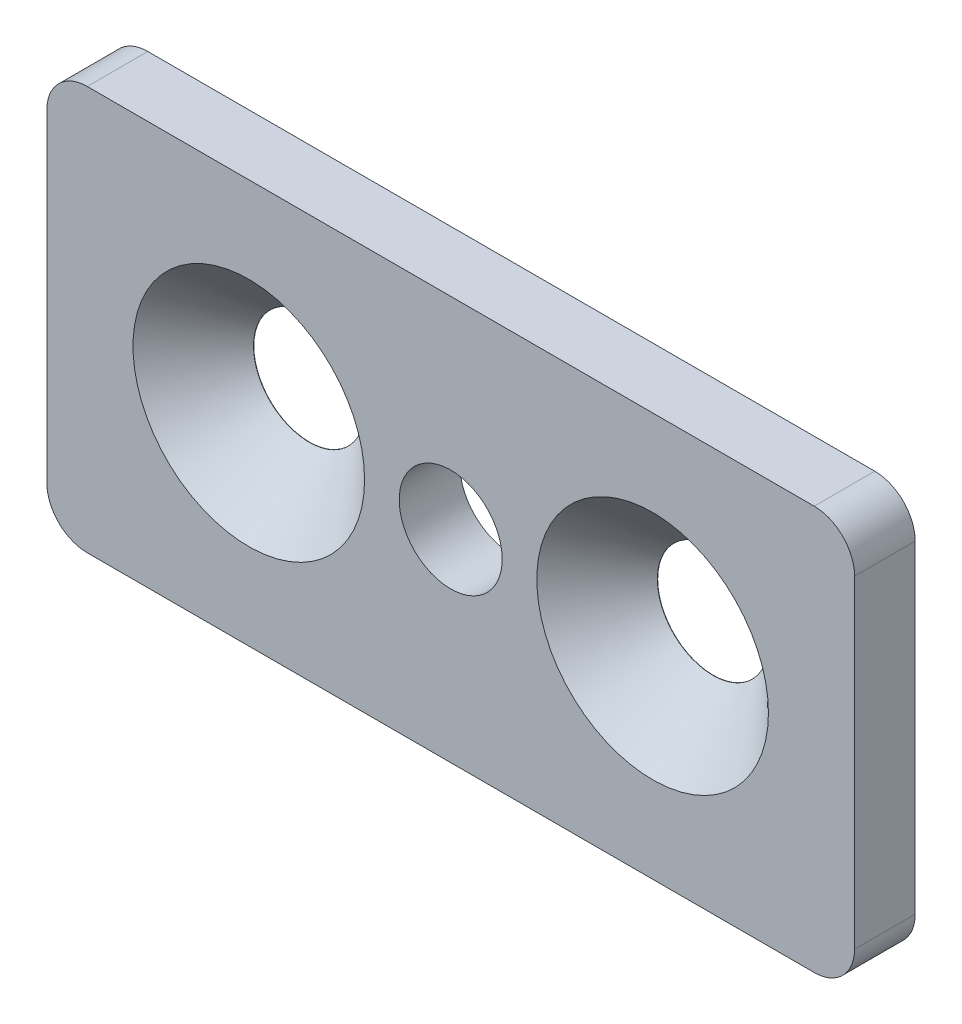
ISO-10303-21;
HEADER;
FILE_DESCRIPTION(('STEP AP214'),'2;1');
FILE_NAME('part.step','',(''),(''),'','','');
FILE_SCHEMA(('AUTOMOTIVE_DESIGN { 1 0 10303 214 1 1 1 1 }'));
ENDSEC;
DATA;
#1=APPLICATION_CONTEXT('core data for automotive mechanical design processes');
#2=APPLICATION_PROTOCOL_DEFINITION('international standard','automotive_design',2000,#1);
#3=PRODUCT_CONTEXT('',#1,'mechanical');
#4=PRODUCT('Part','Part','',(#3));
#5=PRODUCT_RELATED_PRODUCT_CATEGORY('part','',(#4));
#6=PRODUCT_DEFINITION_FORMATION('','',#4);
#7=PRODUCT_DEFINITION_CONTEXT('part definition',#1,'design');
#8=PRODUCT_DEFINITION('design','',#6,#7);
#9=PRODUCT_DEFINITION_SHAPE('','',#8);
#10=(LENGTH_UNIT() NAMED_UNIT(*) SI_UNIT(.MILLI.,.METRE.));
#11=(NAMED_UNIT(*) PLANE_ANGLE_UNIT() SI_UNIT($,.RADIAN.));
#12=(NAMED_UNIT(*) SI_UNIT($,.STERADIAN.) SOLID_ANGLE_UNIT());
#13=UNCERTAINTY_MEASURE_WITH_UNIT(LENGTH_MEASURE(1.E-05),#10,'distance_accuracy_value','');
#14=(GEOMETRIC_REPRESENTATION_CONTEXT(3) GLOBAL_UNCERTAINTY_ASSIGNED_CONTEXT((#13)) GLOBAL_UNIT_ASSIGNED_CONTEXT((#10,
#11,#12)) REPRESENTATION_CONTEXT('',''));
#15=CARTESIAN_POINT('',(0.,0.,0.));
#16=DIRECTION('',(0.,0.,1.));
#17=DIRECTION('',(1.,0.,0.));
#18=AXIS2_PLACEMENT_3D('',#15,#16,#17);
#19=CARTESIAN_POINT('',(2.,2.,3.));
#20=DIRECTION('',(0.,0.,-1.));
#21=DIRECTION('',(-1.,0.,0.));
#22=AXIS2_PLACEMENT_3D('',#19,#20,#21);
#23=PLANE('',#22);
#24=CARTESIAN_POINT('',(10.,10.,3.));
#25=DIRECTION('',(0.,0.,1.));
#26=DIRECTION('',(1.,0.,0.));
#27=AXIS2_PLACEMENT_3D('',#24,#25,#26);
#28=CIRCLE('',#27,5.735);
#29=CARTESIAN_POINT('',(15.735,10.,3.));
#30=VERTEX_POINT('',#29);
#31=EDGE_CURVE('E243',#30,#30,#28,.T.);
#32=ORIENTED_EDGE('',*,*,#31,.F.);
#33=EDGE_LOOP('',(#32));
#34=FACE_BOUND('',#33,.T.);
#35=CARTESIAN_POINT('',(30.,10.,3.));
#36=DIRECTION('',(0.,0.,1.));
#37=DIRECTION('',(1.,0.,0.));
#38=AXIS2_PLACEMENT_3D('',#35,#36,#37);
#39=CIRCLE('',#38,5.735);
#40=CARTESIAN_POINT('',(35.735,10.,3.));
#41=VERTEX_POINT('',#40);
#42=EDGE_CURVE('E168',#41,#41,#39,.T.);
#43=ORIENTED_EDGE('',*,*,#42,.F.);
#44=EDGE_LOOP('',(#43));
#45=FACE_BOUND('',#44,.T.);
#46=CARTESIAN_POINT('',(20.,10.,3.));
#47=DIRECTION('',(0.,0.,1.));
#48=DIRECTION('',(1.,0.,0.));
#49=AXIS2_PLACEMENT_3D('',#46,#47,#48);
#50=CIRCLE('',#49,2.55);
#51=CARTESIAN_POINT('',(22.55,10.,3.));
#52=VERTEX_POINT('',#51);
#53=EDGE_CURVE('E137',#52,#52,#50,.T.);
#54=ORIENTED_EDGE('',*,*,#53,.F.);
#55=EDGE_LOOP('',(#54));
#56=FACE_BOUND('',#55,.T.);
#57=CARTESIAN_POINT('',(2.,2.,3.));
#58=DIRECTION('',(0.,0.,1.));
#59=DIRECTION('',(-1.,0.,0.));
#60=AXIS2_PLACEMENT_3D('',#57,#58,#59);
#61=CIRCLE('',#60,2.);
#62=CARTESIAN_POINT('',(0.,2.,3.));
#63=VERTEX_POINT('',#62);
#64=CARTESIAN_POINT('',(2.,0.,3.));
#65=VERTEX_POINT('',#64);
#66=EDGE_CURVE('E148',#63,#65,#61,.T.);
#67=ORIENTED_EDGE('',*,*,#66,.T.);
#68=DIRECTION('',(1.,0.,0.));
#69=VECTOR('',#68,1.);
#70=CARTESIAN_POINT('',(2.,0.,3.));
#71=LINE('',#70,#69);
#72=CARTESIAN_POINT('',(38.,0.,3.));
#73=VERTEX_POINT('',#72);
#74=EDGE_CURVE('E97',#65,#73,#71,.T.);
#75=ORIENTED_EDGE('',*,*,#74,.T.);
#76=CARTESIAN_POINT('',(38.,2.00000000000001,3.));
#77=DIRECTION('',(0.,0.,1.));
#78=DIRECTION('',(1.,0.,0.));
#79=AXIS2_PLACEMENT_3D('',#76,#77,#78);
#80=CIRCLE('',#79,2.);
#81=CARTESIAN_POINT('',(40.,2.00000000000001,3.));
#82=VERTEX_POINT('',#81);
#83=EDGE_CURVE('E180',#73,#82,#80,.T.);
#84=ORIENTED_EDGE('',*,*,#83,.T.);
#85=DIRECTION('',(0.,1.,0.));
#86=VECTOR('',#85,1.);
#87=CARTESIAN_POINT('',(40.,2.00000000000001,3.));
#88=LINE('',#87,#86);
#89=CARTESIAN_POINT('',(40.,18.,3.));
#90=VERTEX_POINT('',#89);
#91=EDGE_CURVE('E182',#82,#90,#88,.T.);
#92=ORIENTED_EDGE('',*,*,#91,.T.);
#93=CARTESIAN_POINT('',(38.,18.,3.));
#94=DIRECTION('',(0.,0.,1.));
#95=DIRECTION('',(-1.,0.,0.));
#96=AXIS2_PLACEMENT_3D('',#93,#94,#95);
#97=CIRCLE('',#96,2.);
#98=CARTESIAN_POINT('',(38.,20.,3.));
#99=VERTEX_POINT('',#98);
#100=EDGE_CURVE('E115',#90,#99,#97,.T.);
#101=ORIENTED_EDGE('',*,*,#100,.T.);
#102=DIRECTION('',(-1.,0.,0.));
#103=VECTOR('',#102,1.);
#104=CARTESIAN_POINT('',(1.99999999999999,20.,3.));
#105=LINE('',#104,#103);
#106=CARTESIAN_POINT('',(1.99999999999999,20.,3.));
#107=VERTEX_POINT('',#106);
#108=EDGE_CURVE('E110',#99,#107,#105,.T.);
#109=ORIENTED_EDGE('',*,*,#108,.T.);
#110=CARTESIAN_POINT('',(2.,18.,3.));
#111=DIRECTION('',(0.,0.,1.));
#112=DIRECTION('',(-1.,0.,0.));
#113=AXIS2_PLACEMENT_3D('',#110,#111,#112);
#114=CIRCLE('',#113,2.);
#115=CARTESIAN_POINT('',(0.,18.,3.));
#116=VERTEX_POINT('',#115);
#117=EDGE_CURVE('E113',#107,#116,#114,.T.);
#118=ORIENTED_EDGE('',*,*,#117,.T.);
#119=DIRECTION('',(0.,-1.,0.));
#120=VECTOR('',#119,1.);
#121=CARTESIAN_POINT('',(0.,2.,3.));
#122=LINE('',#121,#120);
#123=EDGE_CURVE('E54',#116,#63,#122,.T.);
#124=ORIENTED_EDGE('',*,*,#123,.T.);
#125=EDGE_LOOP('',(#67,#75,#84,#92,#101,#109,#118,#124));
#126=FACE_BOUND('',#125,.T.);
#127=ADVANCED_FACE('F35',(#34,#45,#56,#126),#23,.F.);
#128=CARTESIAN_POINT('',(2.,2.,0.));
#129=DIRECTION('',(0.,0.,-1.));
#130=DIRECTION('',(-1.,0.,0.));
#131=AXIS2_PLACEMENT_3D('',#128,#129,#130);
#132=PLANE('',#131);
#133=CARTESIAN_POINT('',(10.,10.,0.));
#134=DIRECTION('',(0.,0.,-1.));
#135=DIRECTION('',(-1.,0.,0.));
#136=AXIS2_PLACEMENT_3D('',#133,#134,#135);
#137=CIRCLE('',#136,2.74999999999999);
#138=CARTESIAN_POINT('',(7.25000000000001,10.,0.));
#139=VERTEX_POINT('',#138);
#140=EDGE_CURVE('E39',#139,#139,#137,.T.);
#141=ORIENTED_EDGE('',*,*,#140,.F.);
#142=EDGE_LOOP('',(#141));
#143=FACE_BOUND('',#142,.T.);
#144=CARTESIAN_POINT('',(30.,10.,0.));
#145=DIRECTION('',(0.,0.,-1.));
#146=DIRECTION('',(-1.,0.,0.));
#147=AXIS2_PLACEMENT_3D('',#144,#145,#146);
#148=CIRCLE('',#147,2.75);
#149=CARTESIAN_POINT('',(27.25,10.,0.));
#150=VERTEX_POINT('',#149);
#151=EDGE_CURVE('E159',#150,#150,#148,.T.);
#152=ORIENTED_EDGE('',*,*,#151,.F.);
#153=EDGE_LOOP('',(#152));
#154=FACE_BOUND('',#153,.T.);
#155=CARTESIAN_POINT('',(20.,10.,0.));
#156=DIRECTION('',(0.,0.,1.));
#157=DIRECTION('',(1.,0.,0.));
#158=AXIS2_PLACEMENT_3D('',#155,#156,#157);
#159=CIRCLE('',#158,2.55);
#160=CARTESIAN_POINT('',(22.55,10.,0.));
#161=VERTEX_POINT('',#160);
#162=EDGE_CURVE('E161',#161,#161,#159,.T.);
#163=ORIENTED_EDGE('',*,*,#162,.T.);
#164=EDGE_LOOP('',(#163));
#165=FACE_BOUND('',#164,.T.);
#166=CARTESIAN_POINT('',(2.,2.,0.));
#167=DIRECTION('',(0.,0.,1.));
#168=DIRECTION('',(-1.,0.,0.));
#169=AXIS2_PLACEMENT_3D('',#166,#167,#168);
#170=CIRCLE('',#169,2.);
#171=CARTESIAN_POINT('',(0.,2.,0.));
#172=VERTEX_POINT('',#171);
#173=CARTESIAN_POINT('',(2.,0.,0.));
#174=VERTEX_POINT('',#173);
#175=EDGE_CURVE('E133',#172,#174,#170,.T.);
#176=ORIENTED_EDGE('',*,*,#175,.F.);
#177=DIRECTION('',(0.,-1.,0.));
#178=VECTOR('',#177,1.);
#179=CARTESIAN_POINT('',(0.,2.,0.));
#180=LINE('',#179,#178);
#181=CARTESIAN_POINT('',(0.,18.,0.));
#182=VERTEX_POINT('',#181);
#183=EDGE_CURVE('E89',#182,#172,#180,.T.);
#184=ORIENTED_EDGE('',*,*,#183,.F.);
#185=CARTESIAN_POINT('',(2.,18.,0.));
#186=DIRECTION('',(0.,0.,1.));
#187=DIRECTION('',(-1.,0.,0.));
#188=AXIS2_PLACEMENT_3D('',#185,#186,#187);
#189=CIRCLE('',#188,2.);
#190=CARTESIAN_POINT('',(1.99999999999999,20.,0.));
#191=VERTEX_POINT('',#190);
#192=EDGE_CURVE('E83',#191,#182,#189,.T.);
#193=ORIENTED_EDGE('',*,*,#192,.F.);
#194=DIRECTION('',(-1.,0.,0.));
#195=VECTOR('',#194,1.);
#196=CARTESIAN_POINT('',(1.99999999999999,20.,0.));
#197=LINE('',#196,#195);
#198=CARTESIAN_POINT('',(38.,20.,0.));
#199=VERTEX_POINT('',#198);
#200=EDGE_CURVE('E123',#199,#191,#197,.T.);
#201=ORIENTED_EDGE('',*,*,#200,.F.);
#202=CARTESIAN_POINT('',(38.,18.,0.));
#203=DIRECTION('',(0.,0.,1.));
#204=DIRECTION('',(-1.,0.,0.));
#205=AXIS2_PLACEMENT_3D('',#202,#203,#204);
#206=CIRCLE('',#205,2.);
#207=CARTESIAN_POINT('',(40.,18.,0.));
#208=VERTEX_POINT('',#207);
#209=EDGE_CURVE('E143',#208,#199,#206,.T.);
#210=ORIENTED_EDGE('',*,*,#209,.F.);
#211=DIRECTION('',(0.,1.,0.));
#212=VECTOR('',#211,1.);
#213=CARTESIAN_POINT('',(40.,2.00000000000001,0.));
#214=LINE('',#213,#212);
#215=CARTESIAN_POINT('',(40.,2.00000000000001,0.));
#216=VERTEX_POINT('',#215);
#217=EDGE_CURVE('E141',#216,#208,#214,.T.);
#218=ORIENTED_EDGE('',*,*,#217,.F.);
#219=CARTESIAN_POINT('',(38.,2.00000000000001,0.));
#220=DIRECTION('',(0.,0.,1.));
#221=DIRECTION('',(1.,0.,0.));
#222=AXIS2_PLACEMENT_3D('',#219,#220,#221);
#223=CIRCLE('',#222,2.);
#224=CARTESIAN_POINT('',(38.,0.,0.));
#225=VERTEX_POINT('',#224);
#226=EDGE_CURVE('E139',#225,#216,#223,.T.);
#227=ORIENTED_EDGE('',*,*,#226,.F.);
#228=DIRECTION('',(1.,0.,0.));
#229=VECTOR('',#228,1.);
#230=CARTESIAN_POINT('',(2.,0.,0.));
#231=LINE('',#230,#229);
#232=EDGE_CURVE('E136',#174,#225,#231,.T.);
#233=ORIENTED_EDGE('',*,*,#232,.F.);
#234=EDGE_LOOP('',(#176,#184,#193,#201,#210,#218,#227,#233));
#235=FACE_BOUND('',#234,.T.);
#236=ADVANCED_FACE('F195',(#143,#154,#165,#235),#132,.T.);
#237=CARTESIAN_POINT('',(2.,2.,3.));
#238=DIRECTION('',(0.,0.,-1.));
#239=DIRECTION('',(-1.,0.,0.));
#240=AXIS2_PLACEMENT_3D('',#237,#238,#239);
#241=CYLINDRICAL_SURFACE('',#240,2.);
#242=ORIENTED_EDGE('',*,*,#175,.T.);
#243=DIRECTION('',(0.,0.,-1.));
#244=VECTOR('',#243,1.);
#245=CARTESIAN_POINT('',(2.,0.,3.));
#246=LINE('',#245,#244);
#247=EDGE_CURVE('E11',#65,#174,#246,.T.);
#248=ORIENTED_EDGE('',*,*,#247,.F.);
#249=ORIENTED_EDGE('',*,*,#66,.F.);
#250=DIRECTION('',(0.,0.,-1.));
#251=VECTOR('',#250,1.);
#252=CARTESIAN_POINT('',(0.,2.,3.));
#253=LINE('',#252,#251);
#254=EDGE_CURVE('E129',#63,#172,#253,.T.);
#255=ORIENTED_EDGE('',*,*,#254,.T.);
#256=EDGE_LOOP('',(#242,#248,#249,#255));
#257=FACE_BOUND('',#256,.T.);
#258=ADVANCED_FACE('F37',(#257),#241,.T.);
#259=CARTESIAN_POINT('',(2.,0.,3.));
#260=DIRECTION('',(0.,1.,0.));
#261=DIRECTION('',(-1.,0.,0.));
#262=AXIS2_PLACEMENT_3D('',#259,#260,#261);
#263=PLANE('',#262);
#264=ORIENTED_EDGE('',*,*,#232,.T.);
#265=DIRECTION('',(0.,0.,-1.));
#266=VECTOR('',#265,1.);
#267=CARTESIAN_POINT('',(38.,0.,3.));
#268=LINE('',#267,#266);
#269=EDGE_CURVE('E45',#73,#225,#268,.T.);
#270=ORIENTED_EDGE('',*,*,#269,.F.);
#271=ORIENTED_EDGE('',*,*,#74,.F.);
#272=ORIENTED_EDGE('',*,*,#247,.T.);
#273=EDGE_LOOP('',(#264,#270,#271,#272));
#274=FACE_BOUND('',#273,.T.);
#275=ADVANCED_FACE('F290',(#274),#263,.F.);
#276=CARTESIAN_POINT('',(38.,2.00000000000001,3.));
#277=DIRECTION('',(0.,0.,-1.));
#278=DIRECTION('',(-1.,0.,0.));
#279=AXIS2_PLACEMENT_3D('',#276,#277,#278);
#280=CYLINDRICAL_SURFACE('',#279,2.);
#281=ORIENTED_EDGE('',*,*,#226,.T.);
#282=DIRECTION('',(0.,0.,-1.));
#283=VECTOR('',#282,1.);
#284=CARTESIAN_POINT('',(40.,2.00000000000001,3.));
#285=LINE('',#284,#283);
#286=EDGE_CURVE('E155',#82,#216,#285,.T.);
#287=ORIENTED_EDGE('',*,*,#286,.F.);
#288=ORIENTED_EDGE('',*,*,#83,.F.);
#289=ORIENTED_EDGE('',*,*,#269,.T.);
#290=EDGE_LOOP('',(#281,#287,#288,#289));
#291=FACE_BOUND('',#290,.T.);
#292=ADVANCED_FACE('F295',(#291),#280,.T.);
#293=CARTESIAN_POINT('',(40.,2.00000000000001,3.));
#294=DIRECTION('',(-1.,0.,0.));
#295=DIRECTION('',(0.,0.,1.));
#296=AXIS2_PLACEMENT_3D('',#293,#294,#295);
#297=PLANE('',#296);
#298=ORIENTED_EDGE('',*,*,#217,.T.);
#299=DIRECTION('',(0.,0.,-1.));
#300=VECTOR('',#299,1.);
#301=CARTESIAN_POINT('',(40.,18.,3.));
#302=LINE('',#301,#300);
#303=EDGE_CURVE('E152',#90,#208,#302,.T.);
#304=ORIENTED_EDGE('',*,*,#303,.F.);
#305=ORIENTED_EDGE('',*,*,#91,.F.);
#306=ORIENTED_EDGE('',*,*,#286,.T.);
#307=EDGE_LOOP('',(#298,#304,#305,#306));
#308=FACE_BOUND('',#307,.T.);
#309=ADVANCED_FACE('F188',(#308),#297,.F.);
#310=CARTESIAN_POINT('',(38.,18.,3.));
#311=DIRECTION('',(0.,0.,-1.));
#312=DIRECTION('',(-1.,0.,0.));
#313=AXIS2_PLACEMENT_3D('',#310,#311,#312);
#314=CYLINDRICAL_SURFACE('',#313,2.);
#315=ORIENTED_EDGE('',*,*,#209,.T.);
#316=DIRECTION('',(0.,0.,-1.));
#317=VECTOR('',#316,1.);
#318=CARTESIAN_POINT('',(38.,20.,3.));
#319=LINE('',#318,#317);
#320=EDGE_CURVE('E124',#99,#199,#319,.T.);
#321=ORIENTED_EDGE('',*,*,#320,.F.);
#322=ORIENTED_EDGE('',*,*,#100,.F.);
#323=ORIENTED_EDGE('',*,*,#303,.T.);
#324=EDGE_LOOP('',(#315,#321,#322,#323));
#325=FACE_BOUND('',#324,.T.);
#326=ADVANCED_FACE('F192',(#325),#314,.T.);
#327=CARTESIAN_POINT('',(1.99999999999999,20.,3.));
#328=DIRECTION('',(0.,-1.,0.));
#329=DIRECTION('',(1.,0.,0.));
#330=AXIS2_PLACEMENT_3D('',#327,#328,#329);
#331=PLANE('',#330);
#332=ORIENTED_EDGE('',*,*,#200,.T.);
#333=DIRECTION('',(0.,0.,-1.));
#334=VECTOR('',#333,1.);
#335=CARTESIAN_POINT('',(1.99999999999999,20.,3.));
#336=LINE('',#335,#334);
#337=EDGE_CURVE('E120',#107,#191,#336,.T.);
#338=ORIENTED_EDGE('',*,*,#337,.F.);
#339=ORIENTED_EDGE('',*,*,#108,.F.);
#340=ORIENTED_EDGE('',*,*,#320,.T.);
#341=EDGE_LOOP('',(#332,#338,#339,#340));
#342=FACE_BOUND('',#341,.T.);
#343=ADVANCED_FACE('F121',(#342),#331,.F.);
#344=CARTESIAN_POINT('',(2.,18.,3.));
#345=DIRECTION('',(0.,0.,-1.));
#346=DIRECTION('',(-1.,0.,0.));
#347=AXIS2_PLACEMENT_3D('',#344,#345,#346);
#348=CYLINDRICAL_SURFACE('',#347,2.);
#349=ORIENTED_EDGE('',*,*,#192,.T.);
#350=DIRECTION('',(0.,0.,-1.));
#351=VECTOR('',#350,1.);
#352=CARTESIAN_POINT('',(0.,18.,3.));
#353=LINE('',#352,#351);
#354=EDGE_CURVE('E125',#116,#182,#353,.T.);
#355=ORIENTED_EDGE('',*,*,#354,.F.);
#356=ORIENTED_EDGE('',*,*,#117,.F.);
#357=ORIENTED_EDGE('',*,*,#337,.T.);
#358=EDGE_LOOP('',(#349,#355,#356,#357));
#359=FACE_BOUND('',#358,.T.);
#360=ADVANCED_FACE('F127',(#359),#348,.T.);
#361=CARTESIAN_POINT('',(0.,2.,3.));
#362=DIRECTION('',(1.,0.,0.));
#363=DIRECTION('',(0.,0.,-1.));
#364=AXIS2_PLACEMENT_3D('',#361,#362,#363);
#365=PLANE('',#364);
#366=ORIENTED_EDGE('',*,*,#183,.T.);
#367=ORIENTED_EDGE('',*,*,#254,.F.);
#368=ORIENTED_EDGE('',*,*,#123,.F.);
#369=ORIENTED_EDGE('',*,*,#354,.T.);
#370=EDGE_LOOP('',(#366,#367,#368,#369));
#371=FACE_BOUND('',#370,.T.);
#372=ADVANCED_FACE('F200',(#371),#365,.F.);
#373=CARTESIAN_POINT('',(20.,10.,3.));
#374=DIRECTION('',(0.,0.,-1.));
#375=DIRECTION('',(-1.,0.,0.));
#376=AXIS2_PLACEMENT_3D('',#373,#374,#375);
#377=CYLINDRICAL_SURFACE('',#376,2.55);
#378=ORIENTED_EDGE('',*,*,#53,.T.);
#379=EDGE_LOOP('',(#378));
#380=FACE_BOUND('',#379,.T.);
#381=ORIENTED_EDGE('',*,*,#162,.F.);
#382=EDGE_LOOP('',(#381));
#383=FACE_BOUND('',#382,.T.);
#384=ADVANCED_FACE('F202',(#380,#383),#377,.F.);
#385=CARTESIAN_POINT('',(30.,10.,3.));
#386=DIRECTION('',(0.,0.,1.));
#387=DIRECTION('',(1.,0.,0.));
#388=AXIS2_PLACEMENT_3D('',#385,#386,#387);
#389=CYLINDRICAL_SURFACE('',#388,2.75);
#390=ORIENTED_EDGE('',*,*,#151,.T.);
#391=EDGE_LOOP('',(#390));
#392=FACE_BOUND('',#391,.T.);
#393=CARTESIAN_POINT('',(30.,10.,0.0149999999999981));
#394=DIRECTION('',(0.,0.,1.));
#395=DIRECTION('',(1.,0.,0.));
#396=AXIS2_PLACEMENT_3D('',#393,#394,#395);
#397=CIRCLE('',#396,2.75);
#398=CARTESIAN_POINT('',(32.75,10.,0.0149999999999981));
#399=VERTEX_POINT('',#398);
#400=EDGE_CURVE('E162',#399,#399,#397,.T.);
#401=ORIENTED_EDGE('',*,*,#400,.T.);
#402=EDGE_LOOP('',(#401));
#403=FACE_BOUND('',#402,.T.);
#404=ADVANCED_FACE('F208',(#392,#403),#389,.F.);
#405=CARTESIAN_POINT('',(30.,10.,3.));
#406=DIRECTION('',(0.,0.,1.));
#407=DIRECTION('',(1.,0.,0.));
#408=AXIS2_PLACEMENT_3D('',#405,#406,#407);
#409=CONICAL_SURFACE('',#408,5.735,0.785398163397447);
#410=ORIENTED_EDGE('',*,*,#400,.F.);
#411=EDGE_LOOP('',(#410));
#412=FACE_BOUND('',#411,.T.);
#413=ORIENTED_EDGE('',*,*,#42,.T.);
#414=EDGE_LOOP('',(#413));
#415=FACE_BOUND('',#414,.T.);
#416=ADVANCED_FACE('F225',(#412,#415),#409,.F.);
#417=CARTESIAN_POINT('',(10.,10.,3.));
#418=DIRECTION('',(0.,0.,1.));
#419=DIRECTION('',(1.,0.,0.));
#420=AXIS2_PLACEMENT_3D('',#417,#418,#419);
#421=CYLINDRICAL_SURFACE('',#420,2.74999999999999);
#422=ORIENTED_EDGE('',*,*,#140,.T.);
#423=EDGE_LOOP('',(#422));
#424=FACE_BOUND('',#423,.T.);
#425=CARTESIAN_POINT('',(10.,10.,0.0149999999999981));
#426=DIRECTION('',(0.,0.,1.));
#427=DIRECTION('',(1.,0.,0.));
#428=AXIS2_PLACEMENT_3D('',#425,#426,#427);
#429=CIRCLE('',#428,2.75);
#430=CARTESIAN_POINT('',(12.75,10.,0.0149999999999981));
#431=VERTEX_POINT('',#430);
#432=EDGE_CURVE('E241',#431,#431,#429,.T.);
#433=ORIENTED_EDGE('',*,*,#432,.T.);
#434=EDGE_LOOP('',(#433));
#435=FACE_BOUND('',#434,.T.);
#436=ADVANCED_FACE('F228',(#424,#435),#421,.F.);
#437=CARTESIAN_POINT('',(10.,10.,3.));
#438=DIRECTION('',(0.,0.,1.));
#439=DIRECTION('',(1.,0.,0.));
#440=AXIS2_PLACEMENT_3D('',#437,#438,#439);
#441=CONICAL_SURFACE('',#440,5.735,0.785398163397448);
#442=ORIENTED_EDGE('',*,*,#432,.F.);
#443=EDGE_LOOP('',(#442));
#444=FACE_BOUND('',#443,.T.);
#445=ORIENTED_EDGE('',*,*,#31,.T.);
#446=EDGE_LOOP('',(#445));
#447=FACE_BOUND('',#446,.T.);
#448=ADVANCED_FACE('F232',(#444,#447),#441,.F.);
#449=CLOSED_SHELL('',(#127,#236,#258,#275,#292,#309,#326,#343,#360,#372,#384,#404,#416,#436,#448));
#450=MANIFOLD_SOLID_BREP('B2',#449);
#451=ADVANCED_BREP_SHAPE_REPRESENTATION('',(#18,#450),#14);
#452=SHAPE_DEFINITION_REPRESENTATION(#9,#451);
ENDSEC;
END-ISO-10303-21;
